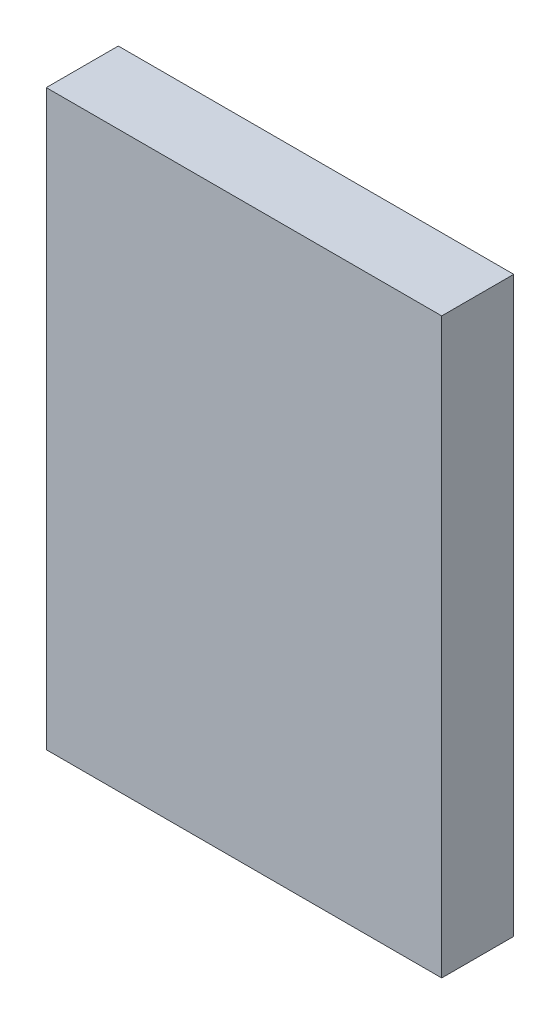
ISO-10303-21;
HEADER;
FILE_DESCRIPTION(('STEP AP214'),'2;1');
FILE_NAME('part.step','',(''),(''),'','','');
FILE_SCHEMA(('AUTOMOTIVE_DESIGN { 1 0 10303 214 1 1 1 1 }'));
ENDSEC;
DATA;
#1=APPLICATION_CONTEXT('core data for automotive mechanical design processes');
#2=APPLICATION_PROTOCOL_DEFINITION('international standard','automotive_design',2000,#1);
#3=PRODUCT_CONTEXT('',#1,'mechanical');
#4=PRODUCT('Part','Part','',(#3));
#5=PRODUCT_RELATED_PRODUCT_CATEGORY('part','',(#4));
#6=PRODUCT_DEFINITION_FORMATION('','',#4);
#7=PRODUCT_DEFINITION_CONTEXT('part definition',#1,'design');
#8=PRODUCT_DEFINITION('design','',#6,#7);
#9=PRODUCT_DEFINITION_SHAPE('','',#8);
#10=(LENGTH_UNIT() NAMED_UNIT(*) SI_UNIT(.MILLI.,.METRE.));
#11=(NAMED_UNIT(*) PLANE_ANGLE_UNIT() SI_UNIT($,.RADIAN.));
#12=(NAMED_UNIT(*) SI_UNIT($,.STERADIAN.) SOLID_ANGLE_UNIT());
#13=UNCERTAINTY_MEASURE_WITH_UNIT(LENGTH_MEASURE(1.E-05),#10,'distance_accuracy_value','');
#14=(GEOMETRIC_REPRESENTATION_CONTEXT(3) GLOBAL_UNCERTAINTY_ASSIGNED_CONTEXT((#13)) GLOBAL_UNIT_ASSIGNED_CONTEXT((#10,
#11,#12)) REPRESENTATION_CONTEXT('',''));
#15=CARTESIAN_POINT('',(0.,0.,0.));
#16=DIRECTION('',(0.,0.,1.));
#17=DIRECTION('',(1.,0.,0.));
#18=AXIS2_PLACEMENT_3D('',#15,#16,#17);
#19=CARTESIAN_POINT('',(-0.14,1.143,0.));
#20=DIRECTION('',(0.,-1.,0.));
#21=DIRECTION('',(0.,0.,-1.));
#22=AXIS2_PLACEMENT_3D('',#19,#20,#21);
#23=PLANE('',#22);
#24=DIRECTION('',(-1.,0.,0.));
#25=VECTOR('',#24,1.);
#26=CARTESIAN_POINT('',(0.14,1.143,0.));
#27=LINE('',#26,#25);
#28=CARTESIAN_POINT('',(0.14,1.143,0.));
#29=VERTEX_POINT('',#28);
#30=CARTESIAN_POINT('',(-0.14,1.143,0.));
#31=VERTEX_POINT('',#30);
#32=EDGE_CURVE('E11',#29,#31,#27,.T.);
#33=ORIENTED_EDGE('',*,*,#32,.F.);
#34=DIRECTION('',(0.,0.,-1.));
#35=VECTOR('',#34,1.);
#36=CARTESIAN_POINT('',(0.14,1.143,0.051));
#37=LINE('',#36,#35);
#38=CARTESIAN_POINT('',(0.14,1.143,0.051));
#39=VERTEX_POINT('',#38);
#40=EDGE_CURVE('E24',#39,#29,#37,.T.);
#41=ORIENTED_EDGE('',*,*,#40,.F.);
#42=DIRECTION('',(1.,0.,0.));
#43=VECTOR('',#42,1.);
#44=CARTESIAN_POINT('',(-0.14,1.143,0.051));
#45=LINE('',#44,#43);
#46=CARTESIAN_POINT('',(-0.14,1.143,0.051));
#47=VERTEX_POINT('',#46);
#48=EDGE_CURVE('E88',#47,#39,#45,.T.);
#49=ORIENTED_EDGE('',*,*,#48,.F.);
#50=DIRECTION('',(0.,0.,1.));
#51=VECTOR('',#50,1.);
#52=CARTESIAN_POINT('',(-0.14,1.143,0.));
#53=LINE('',#52,#51);
#54=EDGE_CURVE('E77',#31,#47,#53,.T.);
#55=ORIENTED_EDGE('',*,*,#54,.F.);
#56=EDGE_LOOP('',(#33,#41,#49,#55));
#57=FACE_BOUND('',#56,.T.);
#58=ADVANCED_FACE('F17',(#57),#23,.T.);
#59=CARTESIAN_POINT('',(0.14,1.143,0.));
#60=DIRECTION('',(1.,0.,0.));
#61=DIRECTION('',(0.,1.,0.));
#62=AXIS2_PLACEMENT_3D('',#59,#60,#61);
#63=PLANE('',#62);
#64=DIRECTION('',(0.,-1.,0.));
#65=VECTOR('',#64,1.);
#66=CARTESIAN_POINT('',(0.14,1.549,0.));
#67=LINE('',#66,#65);
#68=CARTESIAN_POINT('',(0.14,1.549,0.));
#69=VERTEX_POINT('',#68);
#70=EDGE_CURVE('E85',#69,#29,#67,.T.);
#71=ORIENTED_EDGE('',*,*,#70,.F.);
#72=DIRECTION('',(0.,0.,-1.));
#73=VECTOR('',#72,1.);
#74=CARTESIAN_POINT('',(0.14,1.549,0.051));
#75=LINE('',#74,#73);
#76=CARTESIAN_POINT('',(0.14,1.549,0.051));
#77=VERTEX_POINT('',#76);
#78=EDGE_CURVE('E83',#77,#69,#75,.T.);
#79=ORIENTED_EDGE('',*,*,#78,.F.);
#80=DIRECTION('',(0.,1.,0.));
#81=VECTOR('',#80,1.);
#82=CARTESIAN_POINT('',(0.14,1.143,0.051));
#83=LINE('',#82,#81);
#84=EDGE_CURVE('E72',#39,#77,#83,.T.);
#85=ORIENTED_EDGE('',*,*,#84,.F.);
#86=ORIENTED_EDGE('',*,*,#40,.T.);
#87=EDGE_LOOP('',(#71,#79,#85,#86));
#88=FACE_BOUND('',#87,.T.);
#89=ADVANCED_FACE('F90',(#88),#63,.T.);
#90=CARTESIAN_POINT('',(0.14,1.549,0.));
#91=DIRECTION('',(0.,1.,0.));
#92=DIRECTION('',(1.,0.,0.));
#93=AXIS2_PLACEMENT_3D('',#90,#91,#92);
#94=PLANE('',#93);
#95=DIRECTION('',(1.,0.,0.));
#96=VECTOR('',#95,1.);
#97=CARTESIAN_POINT('',(-0.14,1.549,0.));
#98=LINE('',#97,#96);
#99=CARTESIAN_POINT('',(-0.14,1.549,0.));
#100=VERTEX_POINT('',#99);
#101=EDGE_CURVE('E60',#100,#69,#98,.T.);
#102=ORIENTED_EDGE('',*,*,#101,.F.);
#103=DIRECTION('',(0.,0.,-1.));
#104=VECTOR('',#103,1.);
#105=CARTESIAN_POINT('',(-0.14,1.549,0.051));
#106=LINE('',#105,#104);
#107=CARTESIAN_POINT('',(-0.14,1.549,0.051));
#108=VERTEX_POINT('',#107);
#109=EDGE_CURVE('E54',#108,#100,#106,.T.);
#110=ORIENTED_EDGE('',*,*,#109,.F.);
#111=DIRECTION('',(-1.,0.,0.));
#112=VECTOR('',#111,1.);
#113=CARTESIAN_POINT('',(0.14,1.549,0.051));
#114=LINE('',#113,#112);
#115=EDGE_CURVE('E58',#77,#108,#114,.T.);
#116=ORIENTED_EDGE('',*,*,#115,.F.);
#117=ORIENTED_EDGE('',*,*,#78,.T.);
#118=EDGE_LOOP('',(#102,#110,#116,#117));
#119=FACE_BOUND('',#118,.T.);
#120=ADVANCED_FACE('F56',(#119),#94,.T.);
#121=CARTESIAN_POINT('',(-0.14,1.549,0.));
#122=DIRECTION('',(-1.,0.,0.));
#123=DIRECTION('',(0.,0.,1.));
#124=AXIS2_PLACEMENT_3D('',#121,#122,#123);
#125=PLANE('',#124);
#126=DIRECTION('',(0.,1.,0.));
#127=VECTOR('',#126,1.);
#128=CARTESIAN_POINT('',(-0.14,1.143,0.));
#129=LINE('',#128,#127);
#130=EDGE_CURVE('E73',#31,#100,#129,.T.);
#131=ORIENTED_EDGE('',*,*,#130,.F.);
#132=ORIENTED_EDGE('',*,*,#54,.T.);
#133=DIRECTION('',(0.,-1.,0.));
#134=VECTOR('',#133,1.);
#135=CARTESIAN_POINT('',(-0.14,1.549,0.051));
#136=LINE('',#135,#134);
#137=EDGE_CURVE('E70',#108,#47,#136,.T.);
#138=ORIENTED_EDGE('',*,*,#137,.F.);
#139=ORIENTED_EDGE('',*,*,#109,.T.);
#140=EDGE_LOOP('',(#131,#132,#138,#139));
#141=FACE_BOUND('',#140,.T.);
#142=ADVANCED_FACE('F76',(#141),#125,.T.);
#143=CARTESIAN_POINT('',(-0.14,1.549,0.));
#144=DIRECTION('',(0.,0.,-1.));
#145=DIRECTION('',(0.,-1.,0.));
#146=AXIS2_PLACEMENT_3D('',#143,#144,#145);
#147=PLANE('',#146);
#148=ORIENTED_EDGE('',*,*,#101,.T.);
#149=ORIENTED_EDGE('',*,*,#70,.T.);
#150=ORIENTED_EDGE('',*,*,#32,.T.);
#151=ORIENTED_EDGE('',*,*,#130,.T.);
#152=EDGE_LOOP('',(#148,#149,#150,#151));
#153=FACE_BOUND('',#152,.T.);
#154=ADVANCED_FACE('F91',(#153),#147,.T.);
#155=CARTESIAN_POINT('',(-0.14,1.143,0.051));
#156=DIRECTION('',(0.,0.,1.));
#157=DIRECTION('',(1.,0.,0.));
#158=AXIS2_PLACEMENT_3D('',#155,#156,#157);
#159=PLANE('',#158);
#160=ORIENTED_EDGE('',*,*,#48,.T.);
#161=ORIENTED_EDGE('',*,*,#84,.T.);
#162=ORIENTED_EDGE('',*,*,#115,.T.);
#163=ORIENTED_EDGE('',*,*,#137,.T.);
#164=EDGE_LOOP('',(#160,#161,#162,#163));
#165=FACE_BOUND('',#164,.T.);
#166=ADVANCED_FACE('F69',(#165),#159,.T.);
#167=CLOSED_SHELL('',(#58,#89,#120,#142,#154,#166));
#168=MANIFOLD_SOLID_BREP('B1',#167);
#169=ADVANCED_BREP_SHAPE_REPRESENTATION('',(#18,#168),#14);
#170=SHAPE_DEFINITION_REPRESENTATION(#9,#169);
ENDSEC;
END-ISO-10303-21;
